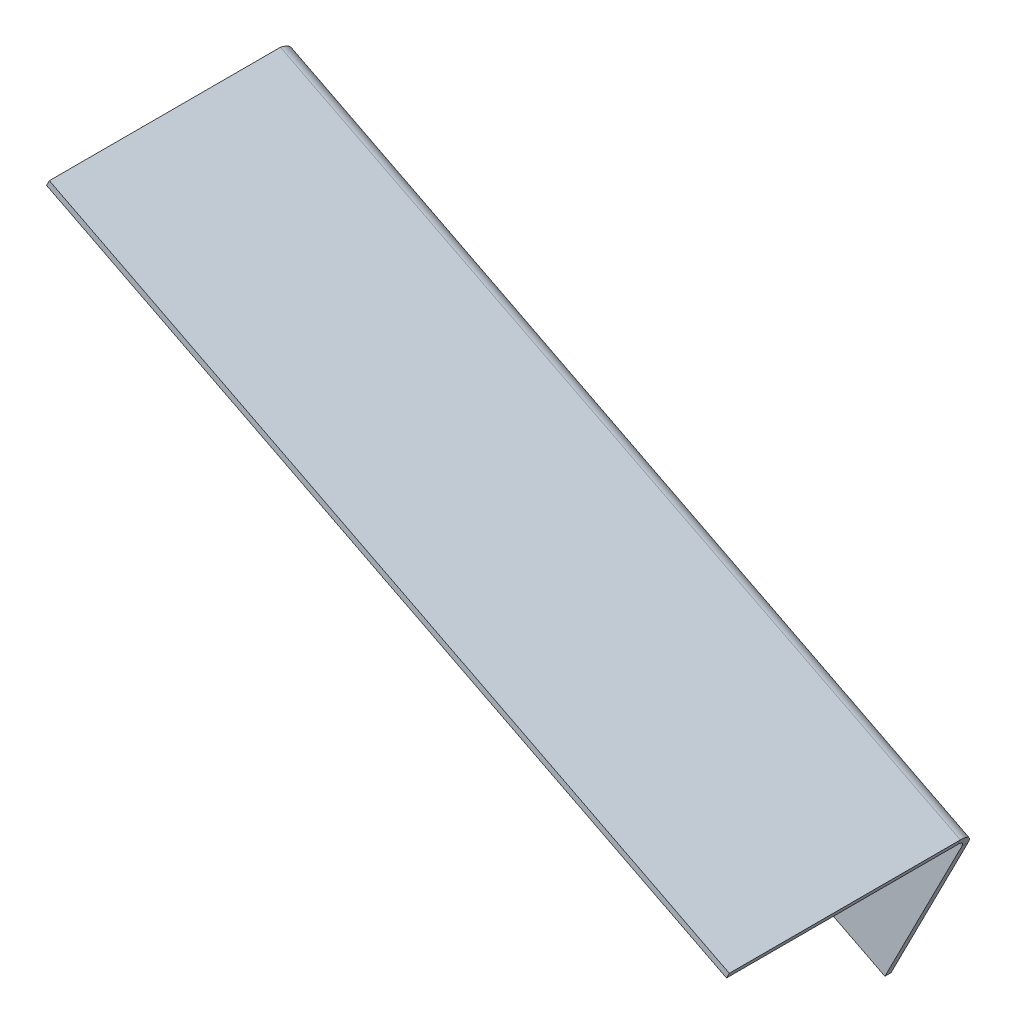
ISO-10303-21;
HEADER;
FILE_DESCRIPTION(('STEP AP214'),'2;1');
FILE_NAME('part.step','',(''),(''),'','','');
FILE_SCHEMA(('AUTOMOTIVE_DESIGN { 1 0 10303 214 1 1 1 1 }'));
ENDSEC;
DATA;
#1=APPLICATION_CONTEXT('core data for automotive mechanical design processes');
#2=APPLICATION_PROTOCOL_DEFINITION('international standard','automotive_design',2000,#1);
#3=PRODUCT_CONTEXT('',#1,'mechanical');
#4=PRODUCT('Part','Part','',(#3));
#5=PRODUCT_RELATED_PRODUCT_CATEGORY('part','',(#4));
#6=PRODUCT_DEFINITION_FORMATION('','',#4);
#7=PRODUCT_DEFINITION_CONTEXT('part definition',#1,'design');
#8=PRODUCT_DEFINITION('design','',#6,#7);
#9=PRODUCT_DEFINITION_SHAPE('','',#8);
#10=(LENGTH_UNIT() NAMED_UNIT(*) SI_UNIT(.MILLI.,.METRE.));
#11=(NAMED_UNIT(*) PLANE_ANGLE_UNIT() SI_UNIT($,.RADIAN.));
#12=(NAMED_UNIT(*) SI_UNIT($,.STERADIAN.) SOLID_ANGLE_UNIT());
#13=UNCERTAINTY_MEASURE_WITH_UNIT(LENGTH_MEASURE(1.E-05),#10,'distance_accuracy_value','');
#14=(GEOMETRIC_REPRESENTATION_CONTEXT(3) GLOBAL_UNCERTAINTY_ASSIGNED_CONTEXT((#13)) GLOBAL_UNIT_ASSIGNED_CONTEXT((#10,
#11,#12)) REPRESENTATION_CONTEXT('',''));
#15=CARTESIAN_POINT('',(0.,0.,0.));
#16=DIRECTION('',(0.,0.,1.));
#17=DIRECTION('',(1.,0.,0.));
#18=AXIS2_PLACEMENT_3D('',#15,#16,#17);
#19=CARTESIAN_POINT('',(222.768605522383,-80.1666996039769,40.));
#20=DIRECTION('',(0.,0.,-1.));
#21=DIRECTION('',(0.891006524188369,-0.453990499739545,0.));
#22=AXIS2_PLACEMENT_3D('',#19,#20,#21);
#23=PLANE('',#22);
#24=DIRECTION('',(0.453990499739545,0.891006524188369,0.));
#25=VECTOR('',#24,1.);
#26=CARTESIAN_POINT('',(0.907980999478863,32.8769348311695,40.));
#27=LINE('',#26,#25);
#28=CARTESIAN_POINT('',(-1.49231306447115E-13,31.0949217827929,40.));
#29=VERTEX_POINT('',#28);
#30=CARTESIAN_POINT('',(0.907980999478863,32.8769348311695,40.));
#31=VERTEX_POINT('',#30);
#32=EDGE_CURVE('E11',#29,#31,#27,.T.);
#33=ORIENTED_EDGE('',*,*,#32,.F.);
#34=DIRECTION('',(0.891006524188369,-0.453990499739545,0.));
#35=VECTOR('',#34,1.);
#36=CARTESIAN_POINT('',(12.5781600805195,24.6860291139533,40.));
#37=LINE('',#36,#35);
#38=CARTESIAN_POINT('',(221.860624522904,-81.9487126523538,40.));
#39=VERTEX_POINT('',#38);
#40=EDGE_CURVE('E98',#29,#39,#37,.T.);
#41=ORIENTED_EDGE('',*,*,#40,.T.);
#42=DIRECTION('',(0.453990499739545,0.891006524188369,0.));
#43=VECTOR('',#42,1.);
#44=CARTESIAN_POINT('',(222.768605522383,-80.1666996039769,40.));
#45=LINE('',#44,#43);
#46=CARTESIAN_POINT('',(222.768605522383,-80.1666996039769,40.));
#47=VERTEX_POINT('',#46);
#48=EDGE_CURVE('E57',#39,#47,#45,.T.);
#49=ORIENTED_EDGE('',*,*,#48,.T.);
#50=DIRECTION('',(0.891006524188369,-0.453990499739545,0.));
#51=VECTOR('',#50,1.);
#52=CARTESIAN_POINT('',(222.768605522383,-80.1666996039769,40.));
#53=LINE('',#52,#51);
#54=EDGE_CURVE('E101',#31,#47,#53,.T.);
#55=ORIENTED_EDGE('',*,*,#54,.F.);
#56=EDGE_LOOP('',(#33,#41,#49,#55));
#57=FACE_BOUND('',#56,.T.);
#58=ADVANCED_FACE('F45',(#57),#23,.F.);
#59=CARTESIAN_POINT('',(222.768605522383,-80.1666996039769,40.));
#60=DIRECTION('',(-0.891006524188369,0.453990499739545,0.));
#61=DIRECTION('',(0.,0.,-1.));
#62=AXIS2_PLACEMENT_3D('',#59,#60,#61);
#63=PLANE('',#62);
#64=ORIENTED_EDGE('',*,*,#48,.F.);
#65=DIRECTION('',(0.,0.,1.));
#66=VECTOR('',#65,1.);
#67=CARTESIAN_POINT('',(221.860624522904,-81.9487126523538,0.));
#68=LINE('',#67,#66);
#69=CARTESIAN_POINT('',(221.860624522904,-81.9487126523537,-35.4));
#70=VERTEX_POINT('',#69);
#71=EDGE_CURVE('E113',#39,#70,#68,.F.);
#72=ORIENTED_EDGE('',*,*,#71,.T.);
#73=DIRECTION('',(0.453990499739546,0.891006524188368,0.));
#74=VECTOR('',#73,1.);
#75=CARTESIAN_POINT('',(222.768605522383,-80.1666996039772,-35.4));
#76=LINE('',#75,#74);
#77=CARTESIAN_POINT('',(222.768605522383,-80.1666996039772,-35.4));
#78=VERTEX_POINT('',#77);
#79=EDGE_CURVE('E228',#70,#78,#76,.T.);
#80=ORIENTED_EDGE('',*,*,#79,.T.);
#81=DIRECTION('',(0.,0.,-1.));
#82=VECTOR('',#81,1.);
#83=CARTESIAN_POINT('',(222.768605522383,-80.1666996039769,40.));
#84=LINE('',#83,#82);
#85=EDGE_CURVE('E293',#47,#78,#84,.T.);
#86=ORIENTED_EDGE('',*,*,#85,.F.);
#87=EDGE_LOOP('',(#64,#72,#80,#86));
#88=FACE_BOUND('',#87,.T.);
#89=ADVANCED_FACE('F334',(#88),#63,.F.);
#90=CARTESIAN_POINT('',(220.680249223581,-84.2653296152436,-35.4));
#91=DIRECTION('',(-0.891006524188368,0.453990499739546,0.));
#92=DIRECTION('',(-0.453990499739546,-0.891006524188368,0.));
#93=AXIS2_PLACEMENT_3D('',#90,#91,#92);
#94=PLANE('',#93);
#95=ORIENTED_EDGE('',*,*,#79,.F.);
#96=CARTESIAN_POINT('',(220.680249223581,-84.2653296152436,-35.4));
#97=DIRECTION('',(0.891006524188368,-0.453990499739546,0.));
#98=DIRECTION('',(0.453990499739546,0.891006524188368,0.));
#99=AXIS2_PLACEMENT_3D('',#96,#97,#98);
#100=CIRCLE('',#99,2.6);
#101=CARTESIAN_POINT('',(220.680249223581,-84.2653296152435,-38.));
#102=VERTEX_POINT('',#101);
#103=EDGE_CURVE('E177',#102,#70,#100,.T.);
#104=ORIENTED_EDGE('',*,*,#103,.F.);
#105=DIRECTION('',(0.,0.,-1.));
#106=VECTOR('',#105,1.);
#107=CARTESIAN_POINT('',(220.680249223581,-84.2653296152435,-40.));
#108=LINE('',#107,#106);
#109=CARTESIAN_POINT('',(220.680249223581,-84.2653296152435,-40.));
#110=VERTEX_POINT('',#109);
#111=EDGE_CURVE('E225',#102,#110,#108,.T.);
#112=ORIENTED_EDGE('',*,*,#111,.T.);
#113=CARTESIAN_POINT('',(220.680249223581,-84.2653296152436,-35.4));
#114=DIRECTION('',(0.891006524188368,-0.453990499739546,0.));
#115=DIRECTION('',(0.453990499739546,0.891006524188368,0.));
#116=AXIS2_PLACEMENT_3D('',#113,#114,#115);
#117=CIRCLE('',#116,4.6);
#118=EDGE_CURVE('E283',#110,#78,#117,.T.);
#119=ORIENTED_EDGE('',*,*,#118,.T.);
#120=EDGE_LOOP('',(#95,#104,#112,#119));
#121=FACE_BOUND('',#120,.T.);
#122=ADVANCED_FACE('F336',(#121),#94,.F.);
#123=CARTESIAN_POINT('',(209.282464442384,-106.634741766307,-40.0000000000001));
#124=DIRECTION('',(-0.89100652418837,0.453990499739543,0.));
#125=DIRECTION('',(-0.453990499739543,-0.89100652418837,0.));
#126=AXIS2_PLACEMENT_3D('',#123,#124,#125);
#127=PLANE('',#126);
#128=ORIENTED_EDGE('',*,*,#111,.F.);
#129=DIRECTION('',(-0.453990499739543,-0.89100652418837,0.));
#130=VECTOR('',#129,1.);
#131=CARTESIAN_POINT('',(209.282464442384,-106.634741766307,-38.0000000000001));
#132=LINE('',#131,#130);
#133=CARTESIAN_POINT('',(195.52917553801,-133.627091055279,-38.0000000000002));
#134=VERTEX_POINT('',#133);
#135=EDGE_CURVE('E123',#102,#134,#132,.T.);
#136=ORIENTED_EDGE('',*,*,#135,.T.);
#137=DIRECTION('',(0.,0.,-1.));
#138=VECTOR('',#137,1.);
#139=CARTESIAN_POINT('',(195.52917553801,-133.627091055279,-40.0000000000002));
#140=LINE('',#139,#138);
#141=CARTESIAN_POINT('',(195.52917553801,-133.627091055279,-40.0000000000002));
#142=VERTEX_POINT('',#141);
#143=EDGE_CURVE('E219',#134,#142,#140,.T.);
#144=ORIENTED_EDGE('',*,*,#143,.T.);
#145=DIRECTION('',(-0.453990499739543,-0.89100652418837,0.));
#146=VECTOR('',#145,1.);
#147=CARTESIAN_POINT('',(209.282464442384,-106.634741766307,-40.0000000000001));
#148=LINE('',#147,#146);
#149=EDGE_CURVE('E302',#110,#142,#148,.T.);
#150=ORIENTED_EDGE('',*,*,#149,.F.);
#151=EDGE_LOOP('',(#128,#136,#144,#150));
#152=FACE_BOUND('',#151,.T.);
#153=ADVANCED_FACE('F337',(#152),#127,.F.);
#154=CARTESIAN_POINT('',(-13.7532889043741,-26.9923492889721,-40.0000000000002));
#155=DIRECTION('',(0.453990499739545,0.891006524188369,0.));
#156=DIRECTION('',(-0.891006524188369,0.453990499739545,0.));
#157=AXIS2_PLACEMENT_3D('',#154,#155,#156);
#158=PLANE('',#157);
#159=ORIENTED_EDGE('',*,*,#143,.F.);
#160=DIRECTION('',(-0.891006524188369,0.453990499739545,0.));
#161=VECTOR('',#160,1.);
#162=CARTESIAN_POINT('',(-13.7532889043741,-26.9923492889721,-38.0000000000002));
#163=LINE('',#162,#161);
#164=CARTESIAN_POINT('',(1.63383261782699E-13,-34.,-38.0000000000002));
#165=VERTEX_POINT('',#164);
#166=EDGE_CURVE('E118',#134,#165,#163,.T.);
#167=ORIENTED_EDGE('',*,*,#166,.T.);
#168=DIRECTION('',(0.,0.,-1.));
#169=VECTOR('',#168,1.);
#170=CARTESIAN_POINT('',(1.66533453693773E-13,-34.,-40.0000000000002));
#171=LINE('',#170,#169);
#172=CARTESIAN_POINT('',(1.66533453693773E-13,-34.,-40.0000000000002));
#173=VERTEX_POINT('',#172);
#174=EDGE_CURVE('E207',#165,#173,#171,.T.);
#175=ORIENTED_EDGE('',*,*,#174,.T.);
#176=DIRECTION('',(-0.891006524188369,0.453990499739545,0.));
#177=VECTOR('',#176,1.);
#178=CARTESIAN_POINT('',(-13.7532889043741,-26.9923492889721,-40.0000000000002));
#179=LINE('',#178,#177);
#180=EDGE_CURVE('E221',#142,#173,#179,.T.);
#181=ORIENTED_EDGE('',*,*,#180,.F.);
#182=EDGE_LOOP('',(#159,#167,#175,#181));
#183=FACE_BOUND('',#182,.T.);
#184=ADVANCED_FACE('F214',(#183),#158,.F.);
#185=CARTESIAN_POINT('',(0.,1.11022302462516E-13,-40.0000000000007));
#186=DIRECTION('',(-1.,0.,0.));
#187=DIRECTION('',(0.,-1.,0.));
#188=AXIS2_PLACEMENT_3D('',#185,#186,#187);
#189=PLANE('',#188);
#190=ORIENTED_EDGE('',*,*,#174,.F.);
#191=DIRECTION('',(0.,-1.,0.));
#192=VECTOR('',#191,1.);
#193=CARTESIAN_POINT('',(1.03320196150477E-13,1.04839702723483E-13,-38.0000000000001));
#194=LINE('',#193,#192);
#195=CARTESIAN_POINT('',(-1.14172494373591E-13,28.1768735649434,-38.));
#196=VERTEX_POINT('',#195);
#197=EDGE_CURVE('E188',#165,#196,#194,.F.);
#198=ORIENTED_EDGE('',*,*,#197,.T.);
#199=CARTESIAN_POINT('',(-2.22044604925031E-13,28.176873564943,-40.));
#200=CARTESIAN_POINT('',(0.,28.1768735649433,-38.));
#201=B_SPLINE_CURVE_WITH_KNOTS('',1,(#199,#200),.UNSPECIFIED.,.F.,.F.,(2,2),(0.,1.),.UNSPECIFIED.);
#202=CARTESIAN_POINT('',(-1.11022302462516E-13,28.1768735649434,-40.0000000000003));
#203=VERTEX_POINT('',#202);
#204=EDGE_CURVE('E203',#196,#203,#201,.F.);
#205=ORIENTED_EDGE('',*,*,#204,.T.);
#206=DIRECTION('',(0.,-1.,0.));
#207=VECTOR('',#206,1.);
#208=CARTESIAN_POINT('',(0.,1.11022302462516E-13,-40.0000000000007));
#209=LINE('',#208,#207);
#210=EDGE_CURVE('E140',#173,#203,#209,.F.);
#211=ORIENTED_EDGE('',*,*,#210,.F.);
#212=EDGE_LOOP('',(#190,#198,#205,#211));
#213=FACE_BOUND('',#212,.T.);
#214=ADVANCED_FACE('F200',(#213),#189,.T.);
#215=CARTESIAN_POINT('',(-2.22044604925031E-13,28.176873564943,-40.));
#216=CARTESIAN_POINT('',(0.0882638366975107,28.4727474124414,-40.));
#217=CARTESIAN_POINT('',(0.175079829838745,28.7637962563151,-39.9702041018989));
#218=CARTESIAN_POINT('',(0.343957491559451,29.3371220878373,-39.8535078643848));
#219=CARTESIAN_POINT('',(0.426828470401534,29.6222465043608,-39.7652910152711));
#220=CARTESIAN_POINT('',(0.581277688291241,30.1689421144936,-39.5344976747031));
#221=CARTESIAN_POINT('',(0.652503555768941,30.4291183187828,-39.3932855269179));
#222=CARTESIAN_POINT('',(0.781178303193576,30.9241080435141,-39.0601068876377));
#223=CARTESIAN_POINT('',(0.838894312979762,31.1604567565792,-38.8659929039103));
#224=CARTESIAN_POINT('',(0.93360987512206,31.5887877199257,-38.4416411668729));
#225=CARTESIAN_POINT('',(0.971304519568423,31.7831586665165,-38.210318582868));
#226=CARTESIAN_POINT('',(1.0251585870898,32.1324505928459,-37.7091144670364));
#227=CARTESIAN_POINT('',(1.04085537653552,32.2857068566243,-37.4404832445849));
#228=CARTESIAN_POINT('',(1.04727985727895,32.5402046112053,-36.887304453595));
#229=CARTESIAN_POINT('',(1.03833671892965,32.6433586544581,-36.6001099714322));
#230=CARTESIAN_POINT('',(0.993212406634422,32.8000626730902,-36.0045544303214));
#231=CARTESIAN_POINT('',(0.957593672706143,32.8516559115432,-35.7037037987809));
#232=CARTESIAN_POINT('',(0.907980999478974,32.8769348311699,-35.4));
#233=CARTESIAN_POINT('',(0.,28.1768735649433,-38.));
#234=CARTESIAN_POINT('',(0.0283180978988521,28.3550974899304,-38.));
#235=CARTESIAN_POINT('',(0.0561665864497567,28.5304158755962,-37.9831588402037));
#236=CARTESIAN_POINT('',(0.109078116923661,28.8761453596507,-37.917200097261));
#237=CARTESIAN_POINT('',(0.134377109219142,29.0482783905549,-37.8673383999358));
#238=CARTESIAN_POINT('',(0.178836699992833,29.3791072030133,-37.7368899900496));
#239=CARTESIAN_POINT('',(0.197921844906521,29.5369514774337,-37.6570744282579));
#240=CARTESIAN_POINT('',(0.228010347136684,29.838454801648,-37.4687560669256));
#241=CARTESIAN_POINT('',(0.238986896948735,29.9830721595462,-37.3590394674276));
#242=CARTESIAN_POINT('',(0.249882854717825,30.2468978867826,-37.1191884856238));
#243=CARTESIAN_POINT('',(0.250014958434805,30.3675481963245,-36.9884409381428));
#244=CARTESIAN_POINT('',(0.23761195090079,30.5868032910861,-36.7051516552814));
#245=CARTESIAN_POINT('',(0.224948442522113,30.684399336415,-36.5533166165045));
#246=CARTESIAN_POINT('',(0.186037863657897,30.8499220267424,-36.2406503433363));
#247=CARTESIAN_POINT('',(0.159754099110417,30.9190431748466,-36.0783230273313));
#248=CARTESIAN_POINT('',(0.0911134156951972,31.0295937164673,-35.7417046780077));
#249=CARTESIAN_POINT('',(0.0496129172333483,31.0696427388391,-35.5716595131321));
#250=CARTESIAN_POINT('',(-1.13082286590238E-13,31.0949217827932,-35.4));
#251=B_SPLINE_SURFACE_WITH_KNOTS('',1,3,((#215,#216,#217,#218,#219,#220,#221,#222,#223,#224,
#225,#226,#227,#228,#229,#230,#231,#232),(#233,#234,#235,#236,#237,#238,#239,#240,#241,#242,
#243,#244,#245,#246,#247,#248,#249,#250)),.UNSPECIFIED.,.F.,.F.,.F.,(2,2),(4,2,2,2,2,2,2,2,4),
(0.,1.),(0.,0.000913182581808218,0.00182636516361614,0.00273954774542407,0.00365273032723199,
0.00456591290903992,0.00547909549084784,0.00639227807265577,0.00730546065446369),.UNSPECIFIED.);
#252=CARTESIAN_POINT('',(0.,28.1768735649433,-38.));
#253=CARTESIAN_POINT('',(0.0283180978988521,28.3550974899304,-38.));
#254=CARTESIAN_POINT('',(0.0561665864497567,28.5304158755962,-37.9831588402037));
#255=CARTESIAN_POINT('',(0.109078116923661,28.8761453596507,-37.917200097261));
#256=CARTESIAN_POINT('',(0.134377109219142,29.0482783905549,-37.8673383999358));
#257=CARTESIAN_POINT('',(0.178836699992833,29.3791072030133,-37.7368899900496));
#258=CARTESIAN_POINT('',(0.197921844906521,29.5369514774337,-37.6570744282579));
#259=CARTESIAN_POINT('',(0.228010347136684,29.838454801648,-37.4687560669256));
#260=CARTESIAN_POINT('',(0.238986896948735,29.9830721595462,-37.3590394674276));
#261=CARTESIAN_POINT('',(0.249882854717825,30.2468978867826,-37.1191884856238));
#262=CARTESIAN_POINT('',(0.250014958434805,30.3675481963245,-36.9884409381428));
#263=CARTESIAN_POINT('',(0.23761195090079,30.5868032910861,-36.7051516552814));
#264=CARTESIAN_POINT('',(0.224948442522113,30.684399336415,-36.5533166165045));
#265=CARTESIAN_POINT('',(0.186037863657897,30.8499220267424,-36.2406503433363));
#266=CARTESIAN_POINT('',(0.159754099110417,30.9190431748466,-36.0783230273313));
#267=CARTESIAN_POINT('',(0.0911134156951972,31.0295937164673,-35.7417046780077));
#268=CARTESIAN_POINT('',(0.0496129172333483,31.0696427388391,-35.5716595131321));
#269=CARTESIAN_POINT('',(-1.13082286590238E-13,31.0949217827932,-35.4));
#270=B_SPLINE_CURVE_WITH_KNOTS('',3,(#252,#253,#254,#255,#256,#257,#258,#259,#260,#261,#262,
#263,#264,#265,#266,#267,#268,#269),.UNSPECIFIED.,.F.,.F.,(4,2,2,2,2,2,2,2,4),(0.,
0.000913182581808218,0.00182636516361614,0.00273954774542407,0.00365273032723199,
0.00456591290903992,0.00547909549084784,0.00639227807265577,0.00730546065446369),.UNSPECIFIED.);
#271=CARTESIAN_POINT('',(0.,31.0949217827931,-35.4));
#272=VERTEX_POINT('',#271);
#273=EDGE_CURVE('E181',#196,#272,#270,.T.);
#274=CARTESIAN_POINT('',(-1.13082286590238E-13,31.0949217827932,-35.4));
#275=CARTESIAN_POINT('',(0.907980999478974,32.8769348311699,-35.4));
#276=B_SPLINE_CURVE_WITH_KNOTS('',1,(#274,#275),.UNSPECIFIED.,.F.,.F.,(2,2),(0.,1.),.UNSPECIFIED.);
#277=CARTESIAN_POINT('',(0.907980999478974,32.8769348311697,-35.4));
#278=VERTEX_POINT('',#277);
#279=EDGE_CURVE('E66',#272,#278,#276,.T.);
#280=CARTESIAN_POINT('',(0.907980999478974,32.8769348311699,-35.4));
#281=CARTESIAN_POINT('',(0.957593672706143,32.8516559115432,-35.7037037987809));
#282=CARTESIAN_POINT('',(0.993212406634422,32.8000626730902,-36.0045544303214));
#283=CARTESIAN_POINT('',(1.03833671892965,32.6433586544581,-36.6001099714322));
#284=CARTESIAN_POINT('',(1.04727985727895,32.5402046112053,-36.887304453595));
#285=CARTESIAN_POINT('',(1.04085537653552,32.2857068566243,-37.4404832445849));
#286=CARTESIAN_POINT('',(1.0251585870898,32.1324505928459,-37.7091144670364));
#287=CARTESIAN_POINT('',(0.971304519568423,31.7831586665165,-38.210318582868));
#288=CARTESIAN_POINT('',(0.93360987512206,31.5887877199257,-38.4416411668729));
#289=CARTESIAN_POINT('',(0.838894312979762,31.1604567565792,-38.8659929039103));
#290=CARTESIAN_POINT('',(0.781178303193576,30.9241080435141,-39.0601068876377));
#291=CARTESIAN_POINT('',(0.652503555768941,30.4291183187828,-39.3932855269179));
#292=CARTESIAN_POINT('',(0.581277688291241,30.1689421144936,-39.5344976747031));
#293=CARTESIAN_POINT('',(0.426828470401534,29.6222465043608,-39.7652910152711));
#294=CARTESIAN_POINT('',(0.343957491559451,29.3371220878373,-39.8535078643848));
#295=CARTESIAN_POINT('',(0.175079829838745,28.7637962563151,-39.9702041018989));
#296=CARTESIAN_POINT('',(0.0882638366975107,28.4727474124414,-40.));
#297=CARTESIAN_POINT('',(-2.22044604925031E-13,28.176873564943,-40.));
#298=B_SPLINE_CURVE_WITH_KNOTS('',3,(#280,#281,#282,#283,#284,#285,#286,#287,#288,#289,#290,
#291,#292,#293,#294,#295,#296,#297),.UNSPECIFIED.,.F.,.F.,(4,2,2,2,2,2,2,2,4),(0.,
0.000913182581808218,0.00182636516361614,0.00273954774542407,0.00365273032723199,
0.00456591290903992,0.00547909549084784,0.00639227807265577,0.00730546065446369),.UNSPECIFIED.);
#299=EDGE_CURVE('E135',#203,#278,#298,.F.);
#300=ORIENTED_EDGE('',*,*,#204,.F.);
#301=ORIENTED_EDGE('',*,*,#273,.T.);
#302=ORIENTED_EDGE('',*,*,#279,.T.);
#303=ORIENTED_EDGE('',*,*,#299,.F.);
#304=EDGE_LOOP('',(#300,#301,#302,#303));
#305=FACE_BOUND('',#304,.T.);
#306=ADVANCED_FACE('F238',(#305),#251,.T.);
#307=CARTESIAN_POINT('',(0.907980999478974,32.8769348311697,0.));
#308=DIRECTION('',(0.891006524188369,-0.453990499739545,0.));
#309=DIRECTION('',(0.,0.,1.));
#310=AXIS2_PLACEMENT_3D('',#307,#308,#309);
#311=PLANE('',#310);
#312=DIRECTION('',(0.,0.,1.));
#313=VECTOR('',#312,1.);
#314=CARTESIAN_POINT('',(-1.50920942409982E-13,31.0949217827929,0.));
#315=LINE('',#314,#313);
#316=EDGE_CURVE('E111',#272,#29,#315,.T.);
#317=ORIENTED_EDGE('',*,*,#316,.T.);
#318=ORIENTED_EDGE('',*,*,#32,.T.);
#319=DIRECTION('',(0.,0.,1.));
#320=VECTOR('',#319,1.);
#321=CARTESIAN_POINT('',(0.907980999478974,32.8769348311697,0.));
#322=LINE('',#321,#320);
#323=EDGE_CURVE('E299',#278,#31,#322,.T.);
#324=ORIENTED_EDGE('',*,*,#323,.F.);
#325=ORIENTED_EDGE('',*,*,#279,.F.);
#326=EDGE_LOOP('',(#317,#318,#324,#325));
#327=FACE_BOUND('',#326,.T.);
#328=ADVANCED_FACE('F47',(#327),#311,.F.);
#329=CARTESIAN_POINT('',(220.680249223581,-84.2653296152436,-35.4));
#330=DIRECTION('',(0.891006524188368,-0.453990499739546,0.));
#331=DIRECTION('',(0.,0.,-1.));
#332=AXIS2_PLACEMENT_3D('',#329,#330,#331);
#333=CYLINDRICAL_SURFACE('',#332,4.6);
#334=DIRECTION('',(0.891006524188369,-0.453990499739545,0.));
#335=VECTOR('',#334,1.);
#336=CARTESIAN_POINT('',(-2.96238834769963,29.6862858193823,-40.));
#337=LINE('',#336,#335);
#338=EDGE_CURVE('E304',#110,#203,#337,.F.);
#339=ORIENTED_EDGE('',*,*,#338,.T.);
#340=ORIENTED_EDGE('',*,*,#299,.T.);
#341=DIRECTION('',(0.891006524188368,-0.453990499739546,0.));
#342=VECTOR('',#341,1.);
#343=CARTESIAN_POINT('',(222.768605522383,-80.1666996039772,-35.4));
#344=LINE('',#343,#342);
#345=EDGE_CURVE('E291',#78,#278,#344,.F.);
#346=ORIENTED_EDGE('',*,*,#345,.F.);
#347=ORIENTED_EDGE('',*,*,#118,.F.);
#348=EDGE_LOOP('',(#339,#340,#346,#347));
#349=FACE_BOUND('',#348,.T.);
#350=ADVANCED_FACE('F142',(#349),#333,.T.);
#351=CARTESIAN_POINT('',(13.4861410799986,26.46804216233,0.));
#352=DIRECTION('',(-0.453990499739545,-0.891006524188369,0.));
#353=DIRECTION('',(0.891006524188369,-0.453990499739545,0.));
#354=AXIS2_PLACEMENT_3D('',#351,#352,#353);
#355=PLANE('',#354);
#356=ORIENTED_EDGE('',*,*,#323,.T.);
#357=ORIENTED_EDGE('',*,*,#54,.T.);
#358=ORIENTED_EDGE('',*,*,#85,.T.);
#359=ORIENTED_EDGE('',*,*,#345,.T.);
#360=EDGE_LOOP('',(#356,#357,#358,#359));
#361=FACE_BOUND('',#360,.T.);
#362=ADVANCED_FACE('F152',(#361),#355,.F.);
#363=CARTESIAN_POINT('',(0.,1.11022302462516E-13,-40.0000000000001));
#364=DIRECTION('',(0.,0.,1.));
#365=DIRECTION('',(0.,-1.,0.));
#366=AXIS2_PLACEMENT_3D('',#363,#364,#365);
#367=PLANE('',#366);
#368=ORIENTED_EDGE('',*,*,#210,.T.);
#369=ORIENTED_EDGE('',*,*,#338,.F.);
#370=ORIENTED_EDGE('',*,*,#149,.T.);
#371=ORIENTED_EDGE('',*,*,#180,.T.);
#372=EDGE_LOOP('',(#368,#369,#370,#371));
#373=FACE_BOUND('',#372,.T.);
#374=ADVANCED_FACE('F158',(#373),#367,.F.);
#375=CARTESIAN_POINT('',(220.680249223581,-84.2653296152436,-35.4));
#376=DIRECTION('',(0.891006524188368,-0.453990499739546,0.));
#377=DIRECTION('',(0.,0.,-1.));
#378=AXIS2_PLACEMENT_3D('',#375,#376,#377);
#379=CYLINDRICAL_SURFACE('',#378,2.6);
#380=DIRECTION('',(0.891006524188368,-0.453990499739546,0.));
#381=VECTOR('',#380,1.);
#382=CARTESIAN_POINT('',(220.680249223581,-84.2653296152435,-38.));
#383=LINE('',#382,#381);
#384=EDGE_CURVE('E176',#102,#196,#383,.F.);
#385=ORIENTED_EDGE('',*,*,#384,.F.);
#386=ORIENTED_EDGE('',*,*,#103,.T.);
#387=DIRECTION('',(0.891006524188369,-0.453990499739545,0.));
#388=VECTOR('',#387,1.);
#389=CARTESIAN_POINT('',(12.5781600805195,24.6860291139533,-35.4));
#390=LINE('',#389,#388);
#391=EDGE_CURVE('E183',#70,#272,#390,.F.);
#392=ORIENTED_EDGE('',*,*,#391,.T.);
#393=ORIENTED_EDGE('',*,*,#273,.F.);
#394=EDGE_LOOP('',(#385,#386,#392,#393));
#395=FACE_BOUND('',#394,.T.);
#396=ADVANCED_FACE('F154',(#395),#379,.F.);
#397=CARTESIAN_POINT('',(12.5781600805195,24.6860291139533,0.));
#398=DIRECTION('',(-0.453990499739545,-0.891006524188369,0.));
#399=DIRECTION('',(0.891006524188369,-0.453990499739545,0.));
#400=AXIS2_PLACEMENT_3D('',#397,#398,#399);
#401=PLANE('',#400);
#402=ORIENTED_EDGE('',*,*,#316,.F.);
#403=ORIENTED_EDGE('',*,*,#391,.F.);
#404=ORIENTED_EDGE('',*,*,#71,.F.);
#405=ORIENTED_EDGE('',*,*,#40,.F.);
#406=EDGE_LOOP('',(#402,#403,#404,#405));
#407=FACE_BOUND('',#406,.T.);
#408=ADVANCED_FACE('F109',(#407),#401,.T.);
#409=CARTESIAN_POINT('',(0.,1.04839702723483E-13,-38.0000000000001));
#410=DIRECTION('',(0.,0.,1.));
#411=DIRECTION('',(0.,-1.,0.));
#412=AXIS2_PLACEMENT_3D('',#409,#410,#411);
#413=PLANE('',#412);
#414=ORIENTED_EDGE('',*,*,#197,.F.);
#415=ORIENTED_EDGE('',*,*,#166,.F.);
#416=ORIENTED_EDGE('',*,*,#135,.F.);
#417=ORIENTED_EDGE('',*,*,#384,.T.);
#418=EDGE_LOOP('',(#414,#415,#416,#417));
#419=FACE_BOUND('',#418,.T.);
#420=ADVANCED_FACE('F210',(#419),#413,.T.);
#421=CLOSED_SHELL('',(#58,#89,#122,#153,#184,#214,#306,#328,#350,#362,#374,#396,#408,#420));
#422=MANIFOLD_SOLID_BREP('B2',#421);
#423=ADVANCED_BREP_SHAPE_REPRESENTATION('',(#18,#422),#14);
#424=SHAPE_DEFINITION_REPRESENTATION(#9,#423);
ENDSEC;
END-ISO-10303-21;
